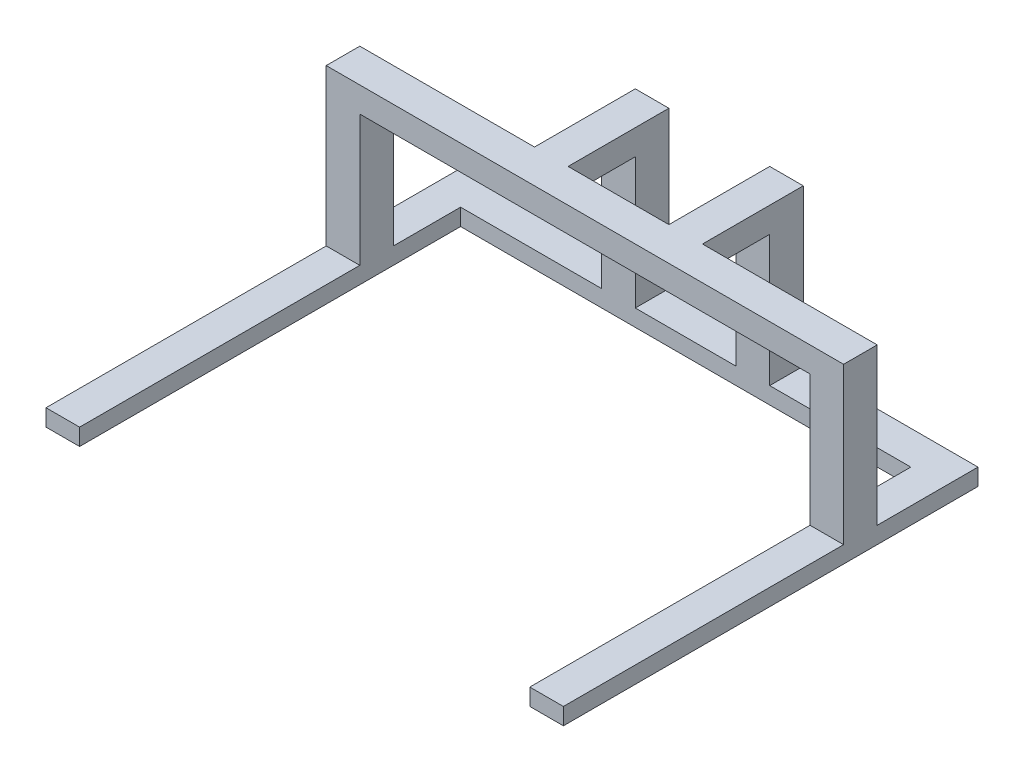
ISO-10303-21;
HEADER;
FILE_DESCRIPTION(('STEP AP214'),'2;1');
FILE_NAME('part.step','',(''),(''),'','','');
FILE_SCHEMA(('AUTOMOTIVE_DESIGN { 1 0 10303 214 1 1 1 1 }'));
ENDSEC;
DATA;
#1=APPLICATION_CONTEXT('core data for automotive mechanical design processes');
#2=APPLICATION_PROTOCOL_DEFINITION('international standard','automotive_design',2000,#1);
#3=PRODUCT_CONTEXT('',#1,'mechanical');
#4=PRODUCT('Part','Part','',(#3));
#5=PRODUCT_RELATED_PRODUCT_CATEGORY('part','',(#4));
#6=PRODUCT_DEFINITION_FORMATION('','',#4);
#7=PRODUCT_DEFINITION_CONTEXT('part definition',#1,'design');
#8=PRODUCT_DEFINITION('design','',#6,#7);
#9=PRODUCT_DEFINITION_SHAPE('','',#8);
#10=(LENGTH_UNIT() NAMED_UNIT(*) SI_UNIT(.MILLI.,.METRE.));
#11=(NAMED_UNIT(*) PLANE_ANGLE_UNIT() SI_UNIT($,.RADIAN.));
#12=(NAMED_UNIT(*) SI_UNIT($,.STERADIAN.) SOLID_ANGLE_UNIT());
#13=UNCERTAINTY_MEASURE_WITH_UNIT(LENGTH_MEASURE(1.E-05),#10,'distance_accuracy_value','');
#14=(GEOMETRIC_REPRESENTATION_CONTEXT(3) GLOBAL_UNCERTAINTY_ASSIGNED_CONTEXT((#13)) GLOBAL_UNIT_ASSIGNED_CONTEXT((#10,
#11,#12)) REPRESENTATION_CONTEXT('',''));
#15=CARTESIAN_POINT('',(0.,0.,0.));
#16=DIRECTION('',(0.,0.,1.));
#17=DIRECTION('',(1.,0.,0.));
#18=AXIS2_PLACEMENT_3D('',#15,#16,#17);
#19=CARTESIAN_POINT('',(0.,4.7625,-3.175));
#20=DIRECTION('',(0.,0.,-1.));
#21=DIRECTION('',(-1.,0.,0.));
#22=AXIS2_PLACEMENT_3D('',#19,#20,#21);
#23=PLANE('',#22);
#24=DIRECTION('',(0.,-1.,0.));
#25=VECTOR('',#24,1.);
#26=CARTESIAN_POINT('',(48.8950000000001,4.7625,-3.175));
#27=LINE('',#26,#25);
#28=CARTESIAN_POINT('',(48.8950000000001,4.7625,-3.175));
#29=VERTEX_POINT('',#28);
#30=CARTESIAN_POINT('',(48.8949999999999,-24.765,-3.175));
#31=VERTEX_POINT('',#30);
#32=EDGE_CURVE('E562',#29,#31,#27,.T.);
#33=ORIENTED_EDGE('',*,*,#32,.T.);
#34=DIRECTION('',(-1.,0.,0.));
#35=VECTOR('',#34,1.);
#36=CARTESIAN_POINT('',(0.,-24.765,-3.175));
#37=LINE('',#36,#35);
#38=CARTESIAN_POINT('',(42.5449999999999,-24.765,-3.175));
#39=VERTEX_POINT('',#38);
#40=EDGE_CURVE('E385',#31,#39,#37,.T.);
#41=ORIENTED_EDGE('',*,*,#40,.T.);
#42=DIRECTION('',(0.,1.,0.));
#43=VECTOR('',#42,1.);
#44=CARTESIAN_POINT('',(42.5450000000001,-27.94,-3.175));
#45=LINE('',#44,#43);
#46=CARTESIAN_POINT('',(42.5450000000001,0.,-3.175));
#47=VERTEX_POINT('',#46);
#48=EDGE_CURVE('E497',#39,#47,#45,.T.);
#49=ORIENTED_EDGE('',*,*,#48,.T.);
#50=DIRECTION('',(1.,0.,0.));
#51=VECTOR('',#50,1.);
#52=CARTESIAN_POINT('',(0.,0.,-3.175));
#53=LINE('',#52,#51);
#54=CARTESIAN_POINT('',(15.875,0.,-3.17499999999999));
#55=VERTEX_POINT('',#54);
#56=EDGE_CURVE('E543',#55,#47,#53,.T.);
#57=ORIENTED_EDGE('',*,*,#56,.F.);
#58=DIRECTION('',(0.,-1.,0.));
#59=VECTOR('',#58,1.);
#60=CARTESIAN_POINT('',(15.875,4.7625,-3.17499999999999));
#61=LINE('',#60,#59);
#62=CARTESIAN_POINT('',(15.875,4.7625,-3.17499999999999));
#63=VERTEX_POINT('',#62);
#64=EDGE_CURVE('E469',#63,#55,#61,.T.);
#65=ORIENTED_EDGE('',*,*,#64,.F.);
#66=DIRECTION('',(1.,0.,0.));
#67=VECTOR('',#66,1.);
#68=CARTESIAN_POINT('',(0.,4.7625,-3.175));
#69=LINE('',#68,#67);
#70=EDGE_CURVE('E535',#63,#29,#69,.T.);
#71=ORIENTED_EDGE('',*,*,#70,.T.);
#72=EDGE_LOOP('',(#33,#41,#49,#57,#65,#71));
#73=FACE_BOUND('',#72,.T.);
#74=ADVANCED_FACE('F113',(#73),#23,.T.);
#75=CARTESIAN_POINT('',(15.875,4.7625,-3.17499999999999));
#76=DIRECTION('',(1.,0.,0.));
#77=DIRECTION('',(0.,0.,1.));
#78=AXIS2_PLACEMENT_3D('',#75,#76,#77);
#79=PLANE('',#78);
#80=DIRECTION('',(0.,1.,0.));
#81=VECTOR('',#80,1.);
#82=CARTESIAN_POINT('',(15.875,-27.94,-15.875));
#83=LINE('',#82,#81);
#84=CARTESIAN_POINT('',(15.875,-24.765,-15.875));
#85=VERTEX_POINT('',#84);
#86=CARTESIAN_POINT('',(15.875,0.,-15.875));
#87=VERTEX_POINT('',#86);
#88=EDGE_CURVE('E434',#85,#87,#83,.T.);
#89=ORIENTED_EDGE('',*,*,#88,.F.);
#90=DIRECTION('',(0.,0.,1.));
#91=VECTOR('',#90,1.);
#92=CARTESIAN_POINT('',(15.875,-24.765,-22.225));
#93=LINE('',#92,#91);
#94=CARTESIAN_POINT('',(15.875,-24.765,-22.225));
#95=VERTEX_POINT('',#94);
#96=EDGE_CURVE('E375',#95,#85,#93,.T.);
#97=ORIENTED_EDGE('',*,*,#96,.F.);
#98=DIRECTION('',(0.,-1.,0.));
#99=VECTOR('',#98,1.);
#100=CARTESIAN_POINT('',(15.875,4.7625,-22.225));
#101=LINE('',#100,#99);
#102=CARTESIAN_POINT('',(15.875,4.7625,-22.225));
#103=VERTEX_POINT('',#102);
#104=EDGE_CURVE('E465',#103,#95,#101,.T.);
#105=ORIENTED_EDGE('',*,*,#104,.F.);
#106=DIRECTION('',(0.,0.,-1.));
#107=VECTOR('',#106,1.);
#108=CARTESIAN_POINT('',(15.875,4.7625,-3.17499999999999));
#109=LINE('',#108,#107);
#110=EDGE_CURVE('E454',#63,#103,#109,.T.);
#111=ORIENTED_EDGE('',*,*,#110,.F.);
#112=ORIENTED_EDGE('',*,*,#64,.T.);
#113=DIRECTION('',(0.,0.,-1.));
#114=VECTOR('',#113,1.);
#115=CARTESIAN_POINT('',(15.875,0.,-3.17499999999999));
#116=LINE('',#115,#114);
#117=EDGE_CURVE('E450',#55,#87,#116,.T.);
#118=ORIENTED_EDGE('',*,*,#117,.T.);
#119=EDGE_LOOP('',(#89,#97,#105,#111,#112,#118));
#120=FACE_BOUND('',#119,.T.);
#121=ADVANCED_FACE('F678',(#120),#79,.T.);
#122=DIRECTION('',(0.,1.,0.));
#123=VECTOR('',#122,1.);
#124=CARTESIAN_POINT('',(-42.5449999999999,-27.94,-3.17499999999999));
#125=LINE('',#124,#123);
#126=CARTESIAN_POINT('',(-42.5449999999999,-24.765,-3.17499999999999));
#127=VERTEX_POINT('',#126);
#128=CARTESIAN_POINT('',(-42.5449999999999,0.,-3.17499999999999));
#129=VERTEX_POINT('',#128);
#130=EDGE_CURVE('E519',#127,#129,#125,.T.);
#131=ORIENTED_EDGE('',*,*,#130,.F.);
#132=DIRECTION('',(-1.,0.,0.));
#133=VECTOR('',#132,1.);
#134=CARTESIAN_POINT('',(0.,-24.765,-3.175));
#135=LINE('',#134,#133);
#136=CARTESIAN_POINT('',(-48.8949999999999,-24.765,-3.17499999999999));
#137=VERTEX_POINT('',#136);
#138=EDGE_CURVE('E414',#127,#137,#135,.T.);
#139=ORIENTED_EDGE('',*,*,#138,.T.);
#140=DIRECTION('',(0.,-1.,0.));
#141=VECTOR('',#140,1.);
#142=CARTESIAN_POINT('',(-48.8949999999999,4.7625,-3.17499999999999));
#143=LINE('',#142,#141);
#144=CARTESIAN_POINT('',(-48.8949999999999,4.7625,-3.17499999999999));
#145=VERTEX_POINT('',#144);
#146=EDGE_CURVE('E555',#145,#137,#143,.T.);
#147=ORIENTED_EDGE('',*,*,#146,.F.);
#148=CARTESIAN_POINT('',(-15.875,4.7625,-3.17499999999999));
#149=VERTEX_POINT('',#148);
#150=EDGE_CURVE('E529',#145,#149,#69,.T.);
#151=ORIENTED_EDGE('',*,*,#150,.T.);
#152=DIRECTION('',(0.,-1.,0.));
#153=VECTOR('',#152,1.);
#154=CARTESIAN_POINT('',(-15.875,4.7625,-3.17499999999999));
#155=LINE('',#154,#153);
#156=CARTESIAN_POINT('',(-15.875,0.,-3.17499999999999));
#157=VERTEX_POINT('',#156);
#158=EDGE_CURVE('E123',#149,#157,#155,.T.);
#159=ORIENTED_EDGE('',*,*,#158,.T.);
#160=EDGE_CURVE('E538',#129,#157,#53,.T.);
#161=ORIENTED_EDGE('',*,*,#160,.F.);
#162=EDGE_LOOP('',(#131,#139,#147,#151,#159,#161));
#163=FACE_BOUND('',#162,.T.);
#164=ADVANCED_FACE('F595',(#163),#23,.T.);
#165=CARTESIAN_POINT('',(-15.875,4.7625,-3.17499999999999));
#166=DIRECTION('',(-1.,0.,0.));
#167=DIRECTION('',(0.,0.,1.));
#168=AXIS2_PLACEMENT_3D('',#165,#166,#167);
#169=PLANE('',#168);
#170=DIRECTION('',(0.,-1.,0.));
#171=VECTOR('',#170,1.);
#172=CARTESIAN_POINT('',(-15.875,4.7625,-22.225));
#173=LINE('',#172,#171);
#174=CARTESIAN_POINT('',(-15.875,4.7625,-22.225));
#175=VERTEX_POINT('',#174);
#176=CARTESIAN_POINT('',(-15.875,-24.765,-22.225));
#177=VERTEX_POINT('',#176);
#178=EDGE_CURVE('E563',#175,#177,#173,.T.);
#179=ORIENTED_EDGE('',*,*,#178,.T.);
#180=DIRECTION('',(0.,0.,1.));
#181=VECTOR('',#180,1.);
#182=CARTESIAN_POINT('',(-15.875,-24.765,-22.225));
#183=LINE('',#182,#181);
#184=CARTESIAN_POINT('',(-15.875,-24.765,-15.875));
#185=VERTEX_POINT('',#184);
#186=EDGE_CURVE('E404',#177,#185,#183,.T.);
#187=ORIENTED_EDGE('',*,*,#186,.T.);
#188=DIRECTION('',(0.,1.,0.));
#189=VECTOR('',#188,1.);
#190=CARTESIAN_POINT('',(-15.875,-27.94,-15.875));
#191=LINE('',#190,#189);
#192=CARTESIAN_POINT('',(-15.875,0.,-15.875));
#193=VERTEX_POINT('',#192);
#194=EDGE_CURVE('E476',#185,#193,#191,.T.);
#195=ORIENTED_EDGE('',*,*,#194,.T.);
#196=DIRECTION('',(0.,0.,-1.));
#197=VECTOR('',#196,1.);
#198=CARTESIAN_POINT('',(-15.875,0.,-3.17499999999999));
#199=LINE('',#198,#197);
#200=EDGE_CURVE('E574',#157,#193,#199,.T.);
#201=ORIENTED_EDGE('',*,*,#200,.F.);
#202=ORIENTED_EDGE('',*,*,#158,.F.);
#203=DIRECTION('',(0.,0.,-1.));
#204=VECTOR('',#203,1.);
#205=CARTESIAN_POINT('',(-15.875,4.7625,-3.17499999999999));
#206=LINE('',#205,#204);
#207=EDGE_CURVE('E577',#149,#175,#206,.T.);
#208=ORIENTED_EDGE('',*,*,#207,.T.);
#209=EDGE_LOOP('',(#179,#187,#195,#201,#202,#208));
#210=FACE_BOUND('',#209,.T.);
#211=ADVANCED_FACE('F599',(#210),#169,.T.);
#212=CARTESIAN_POINT('',(-9.525,4.7625,-3.17499999999999));
#213=DIRECTION('',(-1.,0.,0.));
#214=DIRECTION('',(0.,0.,1.));
#215=AXIS2_PLACEMENT_3D('',#212,#213,#214);
#216=PLANE('',#215);
#217=DIRECTION('',(0.,0.,-1.));
#218=VECTOR('',#217,1.);
#219=CARTESIAN_POINT('',(-9.525,-24.765,0.));
#220=LINE('',#219,#218);
#221=CARTESIAN_POINT('',(-9.525,-24.765,-15.875));
#222=VERTEX_POINT('',#221);
#223=CARTESIAN_POINT('',(-9.525,-24.765,-22.225));
#224=VERTEX_POINT('',#223);
#225=EDGE_CURVE('E430',#222,#224,#220,.T.);
#226=ORIENTED_EDGE('',*,*,#225,.T.);
#227=DIRECTION('',(0.,-1.,0.));
#228=VECTOR('',#227,1.);
#229=CARTESIAN_POINT('',(-9.525,4.7625,-22.225));
#230=LINE('',#229,#228);
#231=CARTESIAN_POINT('',(-9.525,4.7625,-22.225));
#232=VERTEX_POINT('',#231);
#233=EDGE_CURVE('E117',#232,#224,#230,.T.);
#234=ORIENTED_EDGE('',*,*,#233,.F.);
#235=DIRECTION('',(0.,0.,-1.));
#236=VECTOR('',#235,1.);
#237=CARTESIAN_POINT('',(-9.525,4.7625,-3.17499999999999));
#238=LINE('',#237,#236);
#239=CARTESIAN_POINT('',(-9.525,4.7625,-3.175));
#240=VERTEX_POINT('',#239);
#241=EDGE_CURVE('E573',#240,#232,#238,.T.);
#242=ORIENTED_EDGE('',*,*,#241,.F.);
#243=DIRECTION('',(0.,-1.,0.));
#244=VECTOR('',#243,1.);
#245=CARTESIAN_POINT('',(-9.525,4.7625,-3.17499999999999));
#246=LINE('',#245,#244);
#247=CARTESIAN_POINT('',(-9.525,0.,-3.175));
#248=VERTEX_POINT('',#247);
#249=EDGE_CURVE('E12',#240,#248,#246,.T.);
#250=ORIENTED_EDGE('',*,*,#249,.T.);
#251=DIRECTION('',(0.,0.,-1.));
#252=VECTOR('',#251,1.);
#253=CARTESIAN_POINT('',(-9.525,0.,-3.17499999999999));
#254=LINE('',#253,#252);
#255=CARTESIAN_POINT('',(-9.525,0.,-15.875));
#256=VERTEX_POINT('',#255);
#257=EDGE_CURVE('E526',#248,#256,#254,.T.);
#258=ORIENTED_EDGE('',*,*,#257,.T.);
#259=DIRECTION('',(0.,1.,0.));
#260=VECTOR('',#259,1.);
#261=CARTESIAN_POINT('',(-9.525,-27.94,-15.875));
#262=LINE('',#261,#260);
#263=EDGE_CURVE('E479',#222,#256,#262,.T.);
#264=ORIENTED_EDGE('',*,*,#263,.F.);
#265=EDGE_LOOP('',(#226,#234,#242,#250,#258,#264));
#266=FACE_BOUND('',#265,.T.);
#267=ADVANCED_FACE('F684',(#266),#216,.F.);
#268=CARTESIAN_POINT('',(9.525,4.7625,-3.17499999999999));
#269=DIRECTION('',(1.,0.,0.));
#270=DIRECTION('',(0.,0.,1.));
#271=AXIS2_PLACEMENT_3D('',#268,#269,#270);
#272=PLANE('',#271);
#273=DIRECTION('',(0.,0.,-1.));
#274=VECTOR('',#273,1.);
#275=CARTESIAN_POINT('',(9.525,-24.765,0.));
#276=LINE('',#275,#274);
#277=CARTESIAN_POINT('',(9.525,-24.765,-15.875));
#278=VERTEX_POINT('',#277);
#279=CARTESIAN_POINT('',(9.525,-24.765,-22.225));
#280=VERTEX_POINT('',#279);
#281=EDGE_CURVE('E422',#278,#280,#276,.T.);
#282=ORIENTED_EDGE('',*,*,#281,.F.);
#283=DIRECTION('',(0.,1.,0.));
#284=VECTOR('',#283,1.);
#285=CARTESIAN_POINT('',(9.525,-27.94,-15.875));
#286=LINE('',#285,#284);
#287=CARTESIAN_POINT('',(9.525,0.,-15.875));
#288=VERTEX_POINT('',#287);
#289=EDGE_CURVE('E435',#278,#288,#286,.T.);
#290=ORIENTED_EDGE('',*,*,#289,.T.);
#291=DIRECTION('',(0.,0.,-1.));
#292=VECTOR('',#291,1.);
#293=CARTESIAN_POINT('',(9.525,0.,-3.17499999999999));
#294=LINE('',#293,#292);
#295=CARTESIAN_POINT('',(9.525,0.,-3.175));
#296=VERTEX_POINT('',#295);
#297=EDGE_CURVE('E444',#296,#288,#294,.T.);
#298=ORIENTED_EDGE('',*,*,#297,.F.);
#299=DIRECTION('',(0.,-1.,0.));
#300=VECTOR('',#299,1.);
#301=CARTESIAN_POINT('',(9.525,4.7625,-3.17499999999999));
#302=LINE('',#301,#300);
#303=CARTESIAN_POINT('',(9.525,4.7625,-3.175));
#304=VERTEX_POINT('',#303);
#305=EDGE_CURVE('E472',#304,#296,#302,.T.);
#306=ORIENTED_EDGE('',*,*,#305,.F.);
#307=DIRECTION('',(0.,0.,-1.));
#308=VECTOR('',#307,1.);
#309=CARTESIAN_POINT('',(9.525,4.7625,-3.17499999999999));
#310=LINE('',#309,#308);
#311=CARTESIAN_POINT('',(9.525,4.7625,-22.225));
#312=VERTEX_POINT('',#311);
#313=EDGE_CURVE('E449',#304,#312,#310,.T.);
#314=ORIENTED_EDGE('',*,*,#313,.T.);
#315=DIRECTION('',(0.,-1.,0.));
#316=VECTOR('',#315,1.);
#317=CARTESIAN_POINT('',(9.525,4.7625,-22.225));
#318=LINE('',#317,#316);
#319=EDGE_CURVE('E458',#312,#280,#318,.T.);
#320=ORIENTED_EDGE('',*,*,#319,.T.);
#321=EDGE_LOOP('',(#282,#290,#298,#306,#314,#320));
#322=FACE_BOUND('',#321,.T.);
#323=ADVANCED_FACE('F658',(#322),#272,.F.);
#324=EDGE_CURVE('E534',#240,#304,#69,.T.);
#325=ORIENTED_EDGE('',*,*,#324,.T.);
#326=ORIENTED_EDGE('',*,*,#305,.T.);
#327=EDGE_CURVE('E542',#248,#296,#53,.T.);
#328=ORIENTED_EDGE('',*,*,#327,.F.);
#329=ORIENTED_EDGE('',*,*,#249,.F.);
#330=EDGE_LOOP('',(#325,#326,#328,#329));
#331=FACE_BOUND('',#330,.T.);
#332=ADVANCED_FACE('F650',(#331),#23,.T.);
#333=CARTESIAN_POINT('',(0.,0.,0.));
#334=DIRECTION('',(0.,1.,0.));
#335=DIRECTION('',(0.,0.,1.));
#336=AXIS2_PLACEMENT_3D('',#333,#334,#335);
#337=PLANE('',#336);
#338=ORIENTED_EDGE('',*,*,#257,.F.);
#339=ORIENTED_EDGE('',*,*,#327,.T.);
#340=ORIENTED_EDGE('',*,*,#297,.T.);
#341=DIRECTION('',(-1.,0.,0.));
#342=VECTOR('',#341,1.);
#343=CARTESIAN_POINT('',(15.875,0.,-15.875));
#344=LINE('',#343,#342);
#345=EDGE_CURVE('E438',#87,#288,#344,.T.);
#346=ORIENTED_EDGE('',*,*,#345,.F.);
#347=ORIENTED_EDGE('',*,*,#117,.F.);
#348=ORIENTED_EDGE('',*,*,#56,.T.);
#349=DIRECTION('',(0.,0.,1.));
#350=VECTOR('',#349,1.);
#351=CARTESIAN_POINT('',(42.5450000000001,0.,0.));
#352=LINE('',#351,#350);
#353=CARTESIAN_POINT('',(42.5450000000001,0.,3.175));
#354=VERTEX_POINT('',#353);
#355=EDGE_CURVE('E503',#47,#354,#352,.T.);
#356=ORIENTED_EDGE('',*,*,#355,.T.);
#357=DIRECTION('',(1.,0.,0.));
#358=VECTOR('',#357,1.);
#359=CARTESIAN_POINT('',(0.,0.,3.175));
#360=LINE('',#359,#358);
#361=CARTESIAN_POINT('',(-42.5449999999999,0.,3.175));
#362=VERTEX_POINT('',#361);
#363=EDGE_CURVE('E541',#362,#354,#360,.T.);
#364=ORIENTED_EDGE('',*,*,#363,.F.);
#365=DIRECTION('',(0.,0.,1.));
#366=VECTOR('',#365,1.);
#367=CARTESIAN_POINT('',(-42.5449999999999,0.,0.));
#368=LINE('',#367,#366);
#369=EDGE_CURVE('E507',#129,#362,#368,.T.);
#370=ORIENTED_EDGE('',*,*,#369,.F.);
#371=ORIENTED_EDGE('',*,*,#160,.T.);
#372=ORIENTED_EDGE('',*,*,#200,.T.);
#373=DIRECTION('',(1.,0.,0.));
#374=VECTOR('',#373,1.);
#375=CARTESIAN_POINT('',(-15.875,0.,-15.875));
#376=LINE('',#375,#374);
#377=EDGE_CURVE('E485',#193,#256,#376,.T.);
#378=ORIENTED_EDGE('',*,*,#377,.T.);
#379=EDGE_LOOP('',(#338,#339,#340,#346,#347,#348,#356,#364,#370,#371,#372,#378));
#380=FACE_BOUND('',#379,.T.);
#381=ADVANCED_FACE('F604',(#380),#337,.F.);
#382=CARTESIAN_POINT('',(0.,4.7625,3.175));
#383=DIRECTION('',(0.,0.,-1.));
#384=DIRECTION('',(-1.,0.,0.));
#385=AXIS2_PLACEMENT_3D('',#382,#383,#384);
#386=PLANE('',#385);
#387=DIRECTION('',(0.,1.,0.));
#388=VECTOR('',#387,1.);
#389=CARTESIAN_POINT('',(42.5450000000001,-27.94,3.175));
#390=LINE('',#389,#388);
#391=CARTESIAN_POINT('',(42.5450000000001,-24.765,3.175));
#392=VERTEX_POINT('',#391);
#393=EDGE_CURVE('E489',#392,#354,#390,.T.);
#394=ORIENTED_EDGE('',*,*,#393,.F.);
#395=DIRECTION('',(-1.,0.,0.));
#396=VECTOR('',#395,1.);
#397=CARTESIAN_POINT('',(48.8949999999999,-24.765,3.175));
#398=LINE('',#397,#396);
#399=CARTESIAN_POINT('',(48.8949999999999,-24.765,3.175));
#400=VERTEX_POINT('',#399);
#401=EDGE_CURVE('E318',#400,#392,#398,.T.);
#402=ORIENTED_EDGE('',*,*,#401,.F.);
#403=DIRECTION('',(0.,-1.,0.));
#404=VECTOR('',#403,1.);
#405=CARTESIAN_POINT('',(48.8950000000001,4.7625,3.175));
#406=LINE('',#405,#404);
#407=CARTESIAN_POINT('',(48.8950000000001,4.7625,3.175));
#408=VERTEX_POINT('',#407);
#409=EDGE_CURVE('E324',#408,#400,#406,.T.);
#410=ORIENTED_EDGE('',*,*,#409,.F.);
#411=DIRECTION('',(1.,0.,0.));
#412=VECTOR('',#411,1.);
#413=CARTESIAN_POINT('',(0.,4.7625,3.175));
#414=LINE('',#413,#412);
#415=CARTESIAN_POINT('',(-48.8949999999999,4.7625,3.175));
#416=VERTEX_POINT('',#415);
#417=EDGE_CURVE('E533',#416,#408,#414,.T.);
#418=ORIENTED_EDGE('',*,*,#417,.F.);
#419=DIRECTION('',(0.,-1.,0.));
#420=VECTOR('',#419,1.);
#421=CARTESIAN_POINT('',(-48.8949999999999,4.7625,3.175));
#422=LINE('',#421,#420);
#423=CARTESIAN_POINT('',(-48.8949999999999,-24.765,3.175));
#424=VERTEX_POINT('',#423);
#425=EDGE_CURVE('E551',#416,#424,#422,.T.);
#426=ORIENTED_EDGE('',*,*,#425,.T.);
#427=DIRECTION('',(1.,0.,0.));
#428=VECTOR('',#427,1.);
#429=CARTESIAN_POINT('',(-48.8949999999999,-24.765,3.175));
#430=LINE('',#429,#428);
#431=CARTESIAN_POINT('',(-42.5449999999999,-24.765,3.175));
#432=VERTEX_POINT('',#431);
#433=EDGE_CURVE('E341',#424,#432,#430,.T.);
#434=ORIENTED_EDGE('',*,*,#433,.T.);
#435=DIRECTION('',(0.,1.,0.));
#436=VECTOR('',#435,1.);
#437=CARTESIAN_POINT('',(-42.5449999999999,-27.94,3.175));
#438=LINE('',#437,#436);
#439=EDGE_CURVE('E523',#432,#362,#438,.T.);
#440=ORIENTED_EDGE('',*,*,#439,.T.);
#441=ORIENTED_EDGE('',*,*,#363,.T.);
#442=EDGE_LOOP('',(#394,#402,#410,#418,#426,#434,#440,#441));
#443=FACE_BOUND('',#442,.T.);
#444=ADVANCED_FACE('F639',(#443),#386,.F.);
#445=CARTESIAN_POINT('',(0.,4.7625,0.));
#446=DIRECTION('',(0.,1.,0.));
#447=DIRECTION('',(0.,0.,1.));
#448=AXIS2_PLACEMENT_3D('',#445,#446,#447);
#449=PLANE('',#448);
#450=ORIENTED_EDGE('',*,*,#207,.F.);
#451=ORIENTED_EDGE('',*,*,#150,.F.);
#452=DIRECTION('',(0.,0.,1.));
#453=VECTOR('',#452,1.);
#454=CARTESIAN_POINT('',(-48.8949999999999,4.7625,-3.17499999999999));
#455=LINE('',#454,#453);
#456=EDGE_CURVE('E547',#145,#416,#455,.T.);
#457=ORIENTED_EDGE('',*,*,#456,.T.);
#458=ORIENTED_EDGE('',*,*,#417,.T.);
#459=DIRECTION('',(0.,0.,1.));
#460=VECTOR('',#459,1.);
#461=CARTESIAN_POINT('',(48.8950000000001,4.7625,-3.175));
#462=LINE('',#461,#460);
#463=EDGE_CURVE('E559',#29,#408,#462,.T.);
#464=ORIENTED_EDGE('',*,*,#463,.F.);
#465=ORIENTED_EDGE('',*,*,#70,.F.);
#466=ORIENTED_EDGE('',*,*,#110,.T.);
#467=DIRECTION('',(-1.,0.,0.));
#468=VECTOR('',#467,1.);
#469=CARTESIAN_POINT('',(15.875,4.7625,-22.225));
#470=LINE('',#469,#468);
#471=EDGE_CURVE('E445',#103,#312,#470,.T.);
#472=ORIENTED_EDGE('',*,*,#471,.T.);
#473=ORIENTED_EDGE('',*,*,#313,.F.);
#474=ORIENTED_EDGE('',*,*,#324,.F.);
#475=ORIENTED_EDGE('',*,*,#241,.T.);
#476=DIRECTION('',(1.,0.,0.));
#477=VECTOR('',#476,1.);
#478=CARTESIAN_POINT('',(-15.875,4.7625,-22.225));
#479=LINE('',#478,#477);
#480=EDGE_CURVE('E569',#175,#232,#479,.T.);
#481=ORIENTED_EDGE('',*,*,#480,.F.);
#482=EDGE_LOOP('',(#450,#451,#457,#458,#464,#465,#466,#472,#473,#474,#475,#481));
#483=FACE_BOUND('',#482,.T.);
#484=ADVANCED_FACE('F619',(#483),#449,.T.);
#485=CARTESIAN_POINT('',(-15.875,4.7625,-22.225));
#486=DIRECTION('',(0.,0.,-1.));
#487=DIRECTION('',(-1.,0.,0.));
#488=AXIS2_PLACEMENT_3D('',#485,#486,#487);
#489=PLANE('',#488);
#490=ORIENTED_EDGE('',*,*,#233,.T.);
#491=DIRECTION('',(1.,0.,0.));
#492=VECTOR('',#491,1.);
#493=CARTESIAN_POINT('',(0.,-24.765,-22.225));
#494=LINE('',#493,#492);
#495=EDGE_CURVE('E418',#224,#280,#494,.T.);
#496=ORIENTED_EDGE('',*,*,#495,.T.);
#497=ORIENTED_EDGE('',*,*,#319,.F.);
#498=ORIENTED_EDGE('',*,*,#471,.F.);
#499=ORIENTED_EDGE('',*,*,#104,.T.);
#500=DIRECTION('',(-1.,0.,0.));
#501=VECTOR('',#500,1.);
#502=CARTESIAN_POINT('',(48.8949999999999,-24.765,-22.225));
#503=LINE('',#502,#501);
#504=CARTESIAN_POINT('',(48.8949999999999,-24.765,-22.225));
#505=VERTEX_POINT('',#504);
#506=EDGE_CURVE('E372',#505,#95,#503,.T.);
#507=ORIENTED_EDGE('',*,*,#506,.F.);
#508=DIRECTION('',(0.,-1.,0.));
#509=VECTOR('',#508,1.);
#510=CARTESIAN_POINT('',(48.8949999999999,-24.765,-22.225));
#511=LINE('',#510,#509);
#512=CARTESIAN_POINT('',(48.8949999999999,-27.94,-22.225));
#513=VERTEX_POINT('',#512);
#514=EDGE_CURVE('E358',#505,#513,#511,.T.);
#515=ORIENTED_EDGE('',*,*,#514,.T.);
#516=DIRECTION('',(1.,0.,0.));
#517=VECTOR('',#516,1.);
#518=CARTESIAN_POINT('',(-15.875,-27.94,-22.225));
#519=LINE('',#518,#517);
#520=CARTESIAN_POINT('',(-48.8949999999999,-27.94,-22.225));
#521=VERTEX_POINT('',#520);
#522=EDGE_CURVE('E482',#521,#513,#519,.T.);
#523=ORIENTED_EDGE('',*,*,#522,.F.);
#524=DIRECTION('',(0.,-1.,0.));
#525=VECTOR('',#524,1.);
#526=CARTESIAN_POINT('',(-48.8949999999999,-24.765,-22.225));
#527=LINE('',#526,#525);
#528=CARTESIAN_POINT('',(-48.8949999999999,-24.765,-22.225));
#529=VERTEX_POINT('',#528);
#530=EDGE_CURVE('E393',#529,#521,#527,.T.);
#531=ORIENTED_EDGE('',*,*,#530,.F.);
#532=DIRECTION('',(1.,0.,0.));
#533=VECTOR('',#532,1.);
#534=CARTESIAN_POINT('',(-48.8949999999999,-24.765,-22.225));
#535=LINE('',#534,#533);
#536=EDGE_CURVE('E400',#529,#177,#535,.T.);
#537=ORIENTED_EDGE('',*,*,#536,.T.);
#538=ORIENTED_EDGE('',*,*,#178,.F.);
#539=ORIENTED_EDGE('',*,*,#480,.T.);
#540=EDGE_LOOP('',(#490,#496,#497,#498,#499,#507,#515,#523,#531,#537,#538,#539));
#541=FACE_BOUND('',#540,.T.);
#542=ADVANCED_FACE('F115',(#541),#489,.T.);
#543=CARTESIAN_POINT('',(-48.8949999999999,4.7625,-3.17499999999999));
#544=DIRECTION('',(1.,0.,0.));
#545=DIRECTION('',(0.,0.,-1.));
#546=AXIS2_PLACEMENT_3D('',#543,#544,#545);
#547=PLANE('',#546);
#548=DIRECTION('',(0.,0.,-1.));
#549=VECTOR('',#548,1.);
#550=CARTESIAN_POINT('',(-48.8949999999999,-27.94,0.));
#551=LINE('',#550,#549);
#552=CARTESIAN_POINT('',(-48.8949999999999,-27.94,56.134));
#553=VERTEX_POINT('',#552);
#554=EDGE_CURVE('E516',#553,#521,#551,.T.);
#555=ORIENTED_EDGE('',*,*,#554,.F.);
#556=DIRECTION('',(0.,-1.,0.));
#557=VECTOR('',#556,1.);
#558=CARTESIAN_POINT('',(-48.8949999999999,-24.765,56.134));
#559=LINE('',#558,#557);
#560=CARTESIAN_POINT('',(-48.8949999999999,-24.765,56.134));
#561=VERTEX_POINT('',#560);
#562=EDGE_CURVE('E354',#561,#553,#559,.T.);
#563=ORIENTED_EDGE('',*,*,#562,.F.);
#564=DIRECTION('',(0.,0.,-1.));
#565=VECTOR('',#564,1.);
#566=CARTESIAN_POINT('',(-48.8949999999999,-24.765,3.175));
#567=LINE('',#566,#565);
#568=EDGE_CURVE('E337',#561,#424,#567,.T.);
#569=ORIENTED_EDGE('',*,*,#568,.T.);
#570=ORIENTED_EDGE('',*,*,#425,.F.);
#571=ORIENTED_EDGE('',*,*,#456,.F.);
#572=ORIENTED_EDGE('',*,*,#146,.T.);
#573=DIRECTION('',(0.,0.,-1.));
#574=VECTOR('',#573,1.);
#575=CARTESIAN_POINT('',(-48.8949999999999,-24.765,3.175));
#576=LINE('',#575,#574);
#577=EDGE_CURVE('E397',#137,#529,#576,.T.);
#578=ORIENTED_EDGE('',*,*,#577,.T.);
#579=ORIENTED_EDGE('',*,*,#530,.T.);
#580=EDGE_LOOP('',(#555,#563,#569,#570,#571,#572,#578,#579));
#581=FACE_BOUND('',#580,.T.);
#582=ADVANCED_FACE('F615',(#581),#547,.F.);
#583=CARTESIAN_POINT('',(48.8950000000001,4.7625,-3.175));
#584=DIRECTION('',(1.,0.,0.));
#585=DIRECTION('',(0.,0.,-1.));
#586=AXIS2_PLACEMENT_3D('',#583,#584,#585);
#587=PLANE('',#586);
#588=DIRECTION('',(0.,0.,-1.));
#589=VECTOR('',#588,1.);
#590=CARTESIAN_POINT('',(48.8950000000001,-27.94,0.));
#591=LINE('',#590,#589);
#592=CARTESIAN_POINT('',(48.8949999999999,-27.94,56.134));
#593=VERTEX_POINT('',#592);
#594=EDGE_CURVE('E500',#593,#513,#591,.T.);
#595=ORIENTED_EDGE('',*,*,#594,.T.);
#596=ORIENTED_EDGE('',*,*,#514,.F.);
#597=DIRECTION('',(0.,0.,-1.));
#598=VECTOR('',#597,1.);
#599=CARTESIAN_POINT('',(48.8949999999999,-24.765,3.175));
#600=LINE('',#599,#598);
#601=EDGE_CURVE('E366',#31,#505,#600,.T.);
#602=ORIENTED_EDGE('',*,*,#601,.F.);
#603=ORIENTED_EDGE('',*,*,#32,.F.);
#604=ORIENTED_EDGE('',*,*,#463,.T.);
#605=ORIENTED_EDGE('',*,*,#409,.T.);
#606=DIRECTION('',(0.,0.,-1.));
#607=VECTOR('',#606,1.);
#608=CARTESIAN_POINT('',(48.8949999999999,-24.765,3.175));
#609=LINE('',#608,#607);
#610=CARTESIAN_POINT('',(48.8949999999999,-24.765,56.134));
#611=VERTEX_POINT('',#610);
#612=EDGE_CURVE('E303',#611,#400,#609,.T.);
#613=ORIENTED_EDGE('',*,*,#612,.F.);
#614=DIRECTION('',(0.,-1.,0.));
#615=VECTOR('',#614,1.);
#616=CARTESIAN_POINT('',(48.8949999999999,-24.765,56.134));
#617=LINE('',#616,#615);
#618=EDGE_CURVE('E311',#611,#593,#617,.T.);
#619=ORIENTED_EDGE('',*,*,#618,.T.);
#620=EDGE_LOOP('',(#595,#596,#602,#603,#604,#605,#613,#619));
#621=FACE_BOUND('',#620,.T.);
#622=ADVANCED_FACE('F321',(#621),#587,.T.);
#623=CARTESIAN_POINT('',(-42.5449999999999,-27.94,0.));
#624=DIRECTION('',(-1.,0.,0.));
#625=DIRECTION('',(0.,0.,1.));
#626=AXIS2_PLACEMENT_3D('',#623,#624,#625);
#627=PLANE('',#626);
#628=DIRECTION('',(0.,0.,1.));
#629=VECTOR('',#628,1.);
#630=CARTESIAN_POINT('',(-42.5449999999999,-27.94,0.));
#631=LINE('',#630,#629);
#632=CARTESIAN_POINT('',(-42.5449999999999,-27.94,-15.875));
#633=VERTEX_POINT('',#632);
#634=CARTESIAN_POINT('',(-42.5449999999999,-27.94,56.134));
#635=VERTEX_POINT('',#634);
#636=EDGE_CURVE('E513',#633,#635,#631,.T.);
#637=ORIENTED_EDGE('',*,*,#636,.F.);
#638=DIRECTION('',(0.,-1.,0.));
#639=VECTOR('',#638,1.);
#640=CARTESIAN_POINT('',(-42.5449999999999,-24.765,-15.875));
#641=LINE('',#640,#639);
#642=CARTESIAN_POINT('',(-42.5449999999999,-24.765,-15.875));
#643=VERTEX_POINT('',#642);
#644=EDGE_CURVE('E389',#643,#633,#641,.T.);
#645=ORIENTED_EDGE('',*,*,#644,.F.);
#646=DIRECTION('',(0.,0.,-1.));
#647=VECTOR('',#646,1.);
#648=CARTESIAN_POINT('',(-42.5449999999999,-24.765,3.175));
#649=LINE('',#648,#647);
#650=EDGE_CURVE('E411',#127,#643,#649,.T.);
#651=ORIENTED_EDGE('',*,*,#650,.F.);
#652=ORIENTED_EDGE('',*,*,#130,.T.);
#653=ORIENTED_EDGE('',*,*,#369,.T.);
#654=ORIENTED_EDGE('',*,*,#439,.F.);
#655=DIRECTION('',(0.,0.,1.));
#656=VECTOR('',#655,1.);
#657=CARTESIAN_POINT('',(-42.5449999999999,-24.765,3.175));
#658=LINE('',#657,#656);
#659=CARTESIAN_POINT('',(-42.5449999999999,-24.765,56.134));
#660=VERTEX_POINT('',#659);
#661=EDGE_CURVE('E138',#432,#660,#658,.T.);
#662=ORIENTED_EDGE('',*,*,#661,.T.);
#663=DIRECTION('',(0.,-1.,0.));
#664=VECTOR('',#663,1.);
#665=CARTESIAN_POINT('',(-42.5449999999999,-24.765,56.134));
#666=LINE('',#665,#664);
#667=EDGE_CURVE('E350',#660,#635,#666,.T.);
#668=ORIENTED_EDGE('',*,*,#667,.T.);
#669=EDGE_LOOP('',(#637,#645,#651,#652,#653,#654,#662,#668));
#670=FACE_BOUND('',#669,.T.);
#671=ADVANCED_FACE('F609',(#670),#627,.F.);
#672=CARTESIAN_POINT('',(0.,-27.94,0.));
#673=DIRECTION('',(0.,1.,0.));
#674=DIRECTION('',(0.,0.,1.));
#675=AXIS2_PLACEMENT_3D('',#672,#673,#674);
#676=PLANE('',#675);
#677=ORIENTED_EDGE('',*,*,#636,.T.);
#678=DIRECTION('',(-1.,0.,0.));
#679=VECTOR('',#678,1.);
#680=CARTESIAN_POINT('',(-48.8949999999999,-27.94,56.134));
#681=LINE('',#680,#679);
#682=EDGE_CURVE('E335',#635,#553,#681,.T.);
#683=ORIENTED_EDGE('',*,*,#682,.T.);
#684=ORIENTED_EDGE('',*,*,#554,.T.);
#685=ORIENTED_EDGE('',*,*,#522,.T.);
#686=ORIENTED_EDGE('',*,*,#594,.F.);
#687=DIRECTION('',(1.,0.,0.));
#688=VECTOR('',#687,1.);
#689=CARTESIAN_POINT('',(48.8949999999999,-27.94,56.134));
#690=LINE('',#689,#688);
#691=CARTESIAN_POINT('',(42.5449999999999,-27.94,56.134));
#692=VERTEX_POINT('',#691);
#693=EDGE_CURVE('E314',#692,#593,#690,.T.);
#694=ORIENTED_EDGE('',*,*,#693,.F.);
#695=DIRECTION('',(0.,0.,1.));
#696=VECTOR('',#695,1.);
#697=CARTESIAN_POINT('',(42.5450000000001,-27.94,0.));
#698=LINE('',#697,#696);
#699=CARTESIAN_POINT('',(42.5449999999999,-27.94,-15.875));
#700=VERTEX_POINT('',#699);
#701=EDGE_CURVE('E508',#700,#692,#698,.T.);
#702=ORIENTED_EDGE('',*,*,#701,.F.);
#703=DIRECTION('',(1.,0.,0.));
#704=VECTOR('',#703,1.);
#705=CARTESIAN_POINT('',(-15.875,-27.94,-15.875));
#706=LINE('',#705,#704);
#707=EDGE_CURVE('E490',#633,#700,#706,.T.);
#708=ORIENTED_EDGE('',*,*,#707,.F.);
#709=EDGE_LOOP('',(#677,#683,#684,#685,#686,#694,#702,#708));
#710=FACE_BOUND('',#709,.T.);
#711=ADVANCED_FACE('F634',(#710),#676,.F.);
#712=CARTESIAN_POINT('',(42.5450000000001,-27.94,0.));
#713=DIRECTION('',(-1.,0.,0.));
#714=DIRECTION('',(0.,0.,1.));
#715=AXIS2_PLACEMENT_3D('',#712,#713,#714);
#716=PLANE('',#715);
#717=ORIENTED_EDGE('',*,*,#701,.T.);
#718=DIRECTION('',(0.,-1.,0.));
#719=VECTOR('',#718,1.);
#720=CARTESIAN_POINT('',(42.5449999999999,-24.765,56.134));
#721=LINE('',#720,#719);
#722=CARTESIAN_POINT('',(42.5449999999999,-24.765,56.134));
#723=VERTEX_POINT('',#722);
#724=EDGE_CURVE('E317',#723,#692,#721,.T.);
#725=ORIENTED_EDGE('',*,*,#724,.F.);
#726=DIRECTION('',(0.,0.,1.));
#727=VECTOR('',#726,1.);
#728=CARTESIAN_POINT('',(42.5449999999999,-24.765,3.175));
#729=LINE('',#728,#727);
#730=EDGE_CURVE('E130',#392,#723,#729,.T.);
#731=ORIENTED_EDGE('',*,*,#730,.F.);
#732=ORIENTED_EDGE('',*,*,#393,.T.);
#733=ORIENTED_EDGE('',*,*,#355,.F.);
#734=ORIENTED_EDGE('',*,*,#48,.F.);
#735=DIRECTION('',(0.,0.,-1.));
#736=VECTOR('',#735,1.);
#737=CARTESIAN_POINT('',(42.5449999999999,-24.765,3.175));
#738=LINE('',#737,#736);
#739=CARTESIAN_POINT('',(42.5449999999999,-24.765,-15.875));
#740=VERTEX_POINT('',#739);
#741=EDGE_CURVE('E382',#39,#740,#738,.T.);
#742=ORIENTED_EDGE('',*,*,#741,.T.);
#743=DIRECTION('',(0.,-1.,0.));
#744=VECTOR('',#743,1.);
#745=CARTESIAN_POINT('',(42.5449999999999,-24.765,-15.875));
#746=LINE('',#745,#744);
#747=EDGE_CURVE('E362',#740,#700,#746,.T.);
#748=ORIENTED_EDGE('',*,*,#747,.T.);
#749=EDGE_LOOP('',(#717,#725,#731,#732,#733,#734,#742,#748));
#750=FACE_BOUND('',#749,.T.);
#751=ADVANCED_FACE('F668',(#750),#716,.T.);
#752=CARTESIAN_POINT('',(-15.875,-27.94,-15.875));
#753=DIRECTION('',(0.,0.,1.));
#754=DIRECTION('',(1.,0.,0.));
#755=AXIS2_PLACEMENT_3D('',#752,#753,#754);
#756=PLANE('',#755);
#757=ORIENTED_EDGE('',*,*,#377,.F.);
#758=ORIENTED_EDGE('',*,*,#194,.F.);
#759=DIRECTION('',(1.,0.,0.));
#760=VECTOR('',#759,1.);
#761=CARTESIAN_POINT('',(-42.5449999999999,-24.765,-15.875));
#762=LINE('',#761,#760);
#763=EDGE_CURVE('E407',#643,#185,#762,.T.);
#764=ORIENTED_EDGE('',*,*,#763,.F.);
#765=ORIENTED_EDGE('',*,*,#644,.T.);
#766=ORIENTED_EDGE('',*,*,#707,.T.);
#767=ORIENTED_EDGE('',*,*,#747,.F.);
#768=DIRECTION('',(-1.,0.,0.));
#769=VECTOR('',#768,1.);
#770=CARTESIAN_POINT('',(42.5449999999999,-24.765,-15.875));
#771=LINE('',#770,#769);
#772=EDGE_CURVE('E378',#740,#85,#771,.T.);
#773=ORIENTED_EDGE('',*,*,#772,.T.);
#774=ORIENTED_EDGE('',*,*,#88,.T.);
#775=ORIENTED_EDGE('',*,*,#345,.T.);
#776=ORIENTED_EDGE('',*,*,#289,.F.);
#777=DIRECTION('',(1.,0.,0.));
#778=VECTOR('',#777,1.);
#779=CARTESIAN_POINT('',(0.,-24.765,-15.875));
#780=LINE('',#779,#778);
#781=EDGE_CURVE('E426',#222,#278,#780,.T.);
#782=ORIENTED_EDGE('',*,*,#781,.F.);
#783=ORIENTED_EDGE('',*,*,#263,.T.);
#784=EDGE_LOOP('',(#757,#758,#764,#765,#766,#767,#773,#774,#775,#776,#782,#783));
#785=FACE_BOUND('',#784,.T.);
#786=ADVANCED_FACE('F680',(#785),#756,.T.);
#787=CARTESIAN_POINT('',(0.,-24.765,0.));
#788=DIRECTION('',(0.,-1.,0.));
#789=DIRECTION('',(0.,0.,-1.));
#790=AXIS2_PLACEMENT_3D('',#787,#788,#789);
#791=PLANE('',#790);
#792=ORIENTED_EDGE('',*,*,#495,.F.);
#793=ORIENTED_EDGE('',*,*,#225,.F.);
#794=ORIENTED_EDGE('',*,*,#781,.T.);
#795=ORIENTED_EDGE('',*,*,#281,.T.);
#796=EDGE_LOOP('',(#792,#793,#794,#795));
#797=FACE_BOUND('',#796,.T.);
#798=ADVANCED_FACE('F687',(#797),#791,.F.);
#799=CARTESIAN_POINT('',(0.,-24.765,0.));
#800=DIRECTION('',(0.,-1.,0.));
#801=DIRECTION('',(0.,0.,-1.));
#802=AXIS2_PLACEMENT_3D('',#799,#800,#801);
#803=PLANE('',#802);
#804=ORIENTED_EDGE('',*,*,#138,.F.);
#805=ORIENTED_EDGE('',*,*,#650,.T.);
#806=ORIENTED_EDGE('',*,*,#763,.T.);
#807=ORIENTED_EDGE('',*,*,#186,.F.);
#808=ORIENTED_EDGE('',*,*,#536,.F.);
#809=ORIENTED_EDGE('',*,*,#577,.F.);
#810=EDGE_LOOP('',(#804,#805,#806,#807,#808,#809));
#811=FACE_BOUND('',#810,.T.);
#812=ADVANCED_FACE('F625',(#811),#803,.F.);
#813=CARTESIAN_POINT('',(0.,-24.765,0.));
#814=DIRECTION('',(0.,-1.,0.));
#815=DIRECTION('',(0.,0.,-1.));
#816=AXIS2_PLACEMENT_3D('',#813,#814,#815);
#817=PLANE('',#816);
#818=ORIENTED_EDGE('',*,*,#40,.F.);
#819=ORIENTED_EDGE('',*,*,#601,.T.);
#820=ORIENTED_EDGE('',*,*,#506,.T.);
#821=ORIENTED_EDGE('',*,*,#96,.T.);
#822=ORIENTED_EDGE('',*,*,#772,.F.);
#823=ORIENTED_EDGE('',*,*,#741,.F.);
#824=EDGE_LOOP('',(#818,#819,#820,#821,#822,#823));
#825=FACE_BOUND('',#824,.T.);
#826=ADVANCED_FACE('F671',(#825),#817,.F.);
#827=CARTESIAN_POINT('',(-48.8949999999999,-24.765,56.134));
#828=DIRECTION('',(0.,0.,1.));
#829=DIRECTION('',(1.,0.,0.));
#830=AXIS2_PLACEMENT_3D('',#827,#828,#829);
#831=PLANE('',#830);
#832=ORIENTED_EDGE('',*,*,#682,.F.);
#833=ORIENTED_EDGE('',*,*,#667,.F.);
#834=DIRECTION('',(-1.,0.,0.));
#835=VECTOR('',#834,1.);
#836=CARTESIAN_POINT('',(-48.8949999999999,-24.765,56.134));
#837=LINE('',#836,#835);
#838=EDGE_CURVE('E346',#660,#561,#837,.T.);
#839=ORIENTED_EDGE('',*,*,#838,.T.);
#840=ORIENTED_EDGE('',*,*,#562,.T.);
#841=EDGE_LOOP('',(#832,#833,#839,#840));
#842=FACE_BOUND('',#841,.T.);
#843=ADVANCED_FACE('F633',(#842),#831,.T.);
#844=CARTESIAN_POINT('',(0.,-24.765,0.));
#845=DIRECTION('',(0.,1.,0.));
#846=DIRECTION('',(0.,0.,1.));
#847=AXIS2_PLACEMENT_3D('',#844,#845,#846);
#848=PLANE('',#847);
#849=ORIENTED_EDGE('',*,*,#568,.F.);
#850=ORIENTED_EDGE('',*,*,#838,.F.);
#851=ORIENTED_EDGE('',*,*,#661,.F.);
#852=ORIENTED_EDGE('',*,*,#433,.F.);
#853=EDGE_LOOP('',(#849,#850,#851,#852));
#854=FACE_BOUND('',#853,.T.);
#855=ADVANCED_FACE('F636',(#854),#848,.T.);
#856=CARTESIAN_POINT('',(48.8949999999999,-24.765,56.134));
#857=DIRECTION('',(0.,0.,-1.));
#858=DIRECTION('',(-1.,0.,0.));
#859=AXIS2_PLACEMENT_3D('',#856,#857,#858);
#860=PLANE('',#859);
#861=ORIENTED_EDGE('',*,*,#693,.T.);
#862=ORIENTED_EDGE('',*,*,#618,.F.);
#863=DIRECTION('',(1.,0.,0.));
#864=VECTOR('',#863,1.);
#865=CARTESIAN_POINT('',(48.8949999999999,-24.765,56.134));
#866=LINE('',#865,#864);
#867=EDGE_CURVE('E299',#723,#611,#866,.T.);
#868=ORIENTED_EDGE('',*,*,#867,.F.);
#869=ORIENTED_EDGE('',*,*,#724,.T.);
#870=EDGE_LOOP('',(#861,#862,#868,#869));
#871=FACE_BOUND('',#870,.T.);
#872=ADVANCED_FACE('F312',(#871),#860,.F.);
#873=CARTESIAN_POINT('',(0.,-24.765,0.));
#874=DIRECTION('',(0.,1.,0.));
#875=DIRECTION('',(0.,0.,1.));
#876=AXIS2_PLACEMENT_3D('',#873,#874,#875);
#877=PLANE('',#876);
#878=ORIENTED_EDGE('',*,*,#612,.T.);
#879=ORIENTED_EDGE('',*,*,#401,.T.);
#880=ORIENTED_EDGE('',*,*,#730,.T.);
#881=ORIENTED_EDGE('',*,*,#867,.T.);
#882=EDGE_LOOP('',(#878,#879,#880,#881));
#883=FACE_BOUND('',#882,.T.);
#884=ADVANCED_FACE('F301',(#883),#877,.T.);
#885=CLOSED_SHELL('',(#74,#121,#164,#211,#267,#323,#332,#381,#444,#484,#542,#582,#622,#671,#711,
#751,#786,#798,#812,#826,#843,#855,#872,#884));
#886=MANIFOLD_SOLID_BREP('B2',#885);
#887=ADVANCED_BREP_SHAPE_REPRESENTATION('',(#18,#886),#14);
#888=SHAPE_DEFINITION_REPRESENTATION(#9,#887);
ENDSEC;
END-ISO-10303-21;
